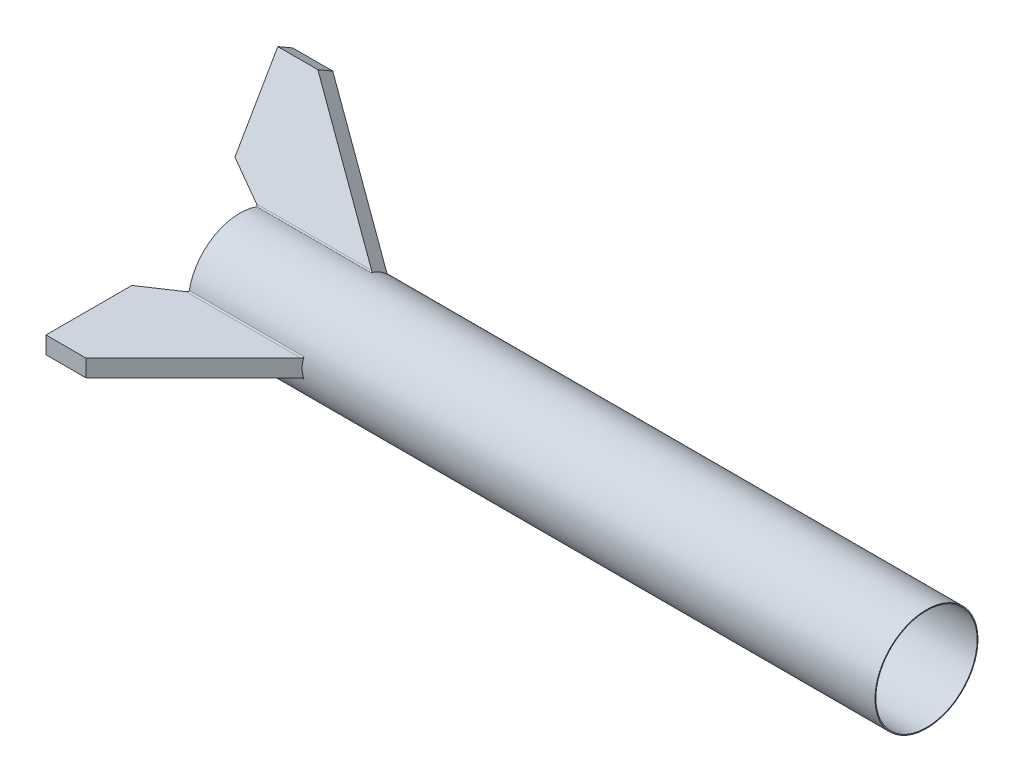
ISO-10303-21;
HEADER;
FILE_DESCRIPTION(('STEP AP214'),'2;1');
FILE_NAME('part.step','',(''),(''),'','','');
FILE_SCHEMA(('AUTOMOTIVE_DESIGN { 1 0 10303 214 1 1 1 1 }'));
ENDSEC;
DATA;
#1=APPLICATION_CONTEXT('core data for automotive mechanical design processes');
#2=APPLICATION_PROTOCOL_DEFINITION('international standard','automotive_design',2000,#1);
#3=PRODUCT_CONTEXT('',#1,'mechanical');
#4=PRODUCT('Part','Part','',(#3));
#5=PRODUCT_RELATED_PRODUCT_CATEGORY('part','',(#4));
#6=PRODUCT_DEFINITION_FORMATION('','',#4);
#7=PRODUCT_DEFINITION_CONTEXT('part definition',#1,'design');
#8=PRODUCT_DEFINITION('design','',#6,#7);
#9=PRODUCT_DEFINITION_SHAPE('','',#8);
#10=(LENGTH_UNIT() NAMED_UNIT(*) SI_UNIT(.MILLI.,.METRE.));
#11=(NAMED_UNIT(*) PLANE_ANGLE_UNIT() SI_UNIT($,.RADIAN.));
#12=(NAMED_UNIT(*) SI_UNIT($,.STERADIAN.) SOLID_ANGLE_UNIT());
#13=UNCERTAINTY_MEASURE_WITH_UNIT(LENGTH_MEASURE(1.E-05),#10,'distance_accuracy_value','');
#14=(GEOMETRIC_REPRESENTATION_CONTEXT(3) GLOBAL_UNCERTAINTY_ASSIGNED_CONTEXT((#13)) GLOBAL_UNIT_ASSIGNED_CONTEXT((#10,
#11,#12)) REPRESENTATION_CONTEXT('',''));
#15=CARTESIAN_POINT('',(0.,0.,0.));
#16=DIRECTION('',(0.,0.,1.));
#17=DIRECTION('',(1.,0.,0.));
#18=AXIS2_PLACEMENT_3D('',#15,#16,#17);
#19=CARTESIAN_POINT('',(-30480.,0.,0.));
#20=DIRECTION('',(1.,0.,0.));
#21=DIRECTION('',(0.,0.,-1.));
#22=AXIS2_PLACEMENT_3D('',#19,#20,#21);
#23=CYLINDRICAL_SURFACE('',#22,4572.);
#24=CARTESIAN_POINT('',(-30480.,0.,0.));
#25=DIRECTION('',(1.,0.,0.));
#26=DIRECTION('',(0.,0.,-1.));
#27=AXIS2_PLACEMENT_3D('',#24,#25,#26);
#28=CIRCLE('',#27,4572.);
#29=CARTESIAN_POINT('',(-30480.,-3455.47625986534,-2993.80490638703));
#30=VERTEX_POINT('',#29);
#31=CARTESIAN_POINT('',(-30480.,3455.47625986538,-2993.80490638698));
#32=VERTEX_POINT('',#31);
#33=EDGE_CURVE('E862',#30,#32,#28,.T.);
#34=ORIENTED_EDGE('',*,*,#33,.T.);
#35=DIRECTION('',(1.,0.,0.));
#36=VECTOR('',#35,1.);
#37=CARTESIAN_POINT('',(-30480.,3455.47625986538,-2993.80490638698));
#38=LINE('',#37,#36);
#39=CARTESIAN_POINT('',(-20301.379881689,3455.47625986538,-2993.80490638698));
#40=VERTEX_POINT('',#39);
#41=EDGE_CURVE('E921',#32,#40,#38,.T.);
#42=ORIENTED_EDGE('',*,*,#41,.T.);
#43=CARTESIAN_POINT('',(-15811.9472052781,0.,0.));
#44=DIRECTION('',(0.707106781186551,0.612372435695794,-0.353553390593266));
#45=DIRECTION('',(0.707106781186544,-0.612372435695801,0.35355339059327));
#46=AXIS2_PLACEMENT_3D('',#43,#44,#45);
#47=ELLIPSE('',#46,6465.78440716975,4572.);
#48=CARTESIAN_POINT('',(-20301.379881689,4320.44923283834,-1495.62777002389));
#49=VERTEX_POINT('',#48);
#50=EDGE_CURVE('E776',#49,#40,#47,.F.);
#51=ORIENTED_EDGE('',*,*,#50,.F.);
#52=DIRECTION('',(1.,0.,0.));
#53=VECTOR('',#52,1.);
#54=CARTESIAN_POINT('',(-30480.,4320.44923283834,-1495.62777002388));
#55=LINE('',#54,#53);
#56=CARTESIAN_POINT('',(-30480.,4320.44923283834,-1495.62777002389));
#57=VERTEX_POINT('',#56);
#58=EDGE_CURVE('E917',#49,#57,#55,.F.);
#59=ORIENTED_EDGE('',*,*,#58,.T.);
#60=CARTESIAN_POINT('',(-30480.,864.972972972973,4489.43267641094));
#61=VERTEX_POINT('',#60);
#62=EDGE_CURVE('E876',#57,#61,#28,.T.);
#63=ORIENTED_EDGE('',*,*,#62,.T.);
#64=DIRECTION('',(1.,0.,0.));
#65=VECTOR('',#64,1.);
#66=CARTESIAN_POINT('',(-30480.,864.972972972973,4489.43267641094));
#67=LINE('',#66,#65);
#68=CARTESIAN_POINT('',(-20301.379881689,864.972972972972,4489.43267641094));
#69=VERTEX_POINT('',#68);
#70=EDGE_CURVE('E851',#61,#69,#67,.T.);
#71=ORIENTED_EDGE('',*,*,#70,.T.);
#72=CARTESIAN_POINT('',(-15811.9472052781,0.,0.));
#73=DIRECTION('',(0.707106781186551,0.,0.707106781186543));
#74=DIRECTION('',(0.707106781186544,0.,-0.707106781186552));
#75=AXIS2_PLACEMENT_3D('',#72,#73,#74);
#76=ELLIPSE('',#75,6465.78440716975,4572.);
#77=CARTESIAN_POINT('',(-20301.379881689,-864.972972972973,4489.43267641094));
#78=VERTEX_POINT('',#77);
#79=EDGE_CURVE('E861',#78,#69,#76,.F.);
#80=ORIENTED_EDGE('',*,*,#79,.F.);
#81=DIRECTION('',(1.,0.,0.));
#82=VECTOR('',#81,1.);
#83=CARTESIAN_POINT('',(-30480.,-864.972972972973,4489.43267641094));
#84=LINE('',#83,#82);
#85=CARTESIAN_POINT('',(-30480.,-864.972972972973,4489.43267641094));
#86=VERTEX_POINT('',#85);
#87=EDGE_CURVE('E854',#78,#86,#84,.F.);
#88=ORIENTED_EDGE('',*,*,#87,.T.);
#89=CARTESIAN_POINT('',(-30480.,-4320.44923283832,-1495.62777002394));
#90=VERTEX_POINT('',#89);
#91=EDGE_CURVE('E857',#86,#90,#28,.T.);
#92=ORIENTED_EDGE('',*,*,#91,.T.);
#93=DIRECTION('',(1.,0.,0.));
#94=VECTOR('',#93,1.);
#95=CARTESIAN_POINT('',(-30480.,-4320.44923283832,-1495.62777002394));
#96=LINE('',#95,#94);
#97=CARTESIAN_POINT('',(-20301.379881689,-4320.44923283832,-1495.62777002394));
#98=VERTEX_POINT('',#97);
#99=EDGE_CURVE('E880',#90,#98,#96,.T.);
#100=ORIENTED_EDGE('',*,*,#99,.T.);
#101=CARTESIAN_POINT('',(-15811.9472052781,0.,0.));
#102=DIRECTION('',(0.707106781186551,-0.612372435695789,-0.353553390593275));
#103=DIRECTION('',(0.707106781186544,0.612372435695796,0.353553390593279));
#104=AXIS2_PLACEMENT_3D('',#101,#102,#103);
#105=ELLIPSE('',#104,6465.78440716975,4572.);
#106=CARTESIAN_POINT('',(-20301.379881689,-3455.47625986534,-2993.80490638703));
#107=VERTEX_POINT('',#106);
#108=EDGE_CURVE('E803',#107,#98,#105,.F.);
#109=ORIENTED_EDGE('',*,*,#108,.F.);
#110=DIRECTION('',(1.,0.,0.));
#111=VECTOR('',#110,1.);
#112=CARTESIAN_POINT('',(-30480.,-3455.47625986534,-2993.80490638703));
#113=LINE('',#112,#111);
#114=EDGE_CURVE('E878',#107,#30,#113,.F.);
#115=ORIENTED_EDGE('',*,*,#114,.T.);
#116=EDGE_LOOP('',(#34,#42,#51,#59,#63,#71,#80,#88,#92,#100,#109,#115));
#117=FACE_BOUND('',#116,.T.);
#118=CARTESIAN_POINT('',(30480.,0.,0.));
#119=DIRECTION('',(1.,0.,0.));
#120=DIRECTION('',(0.,0.,-1.));
#121=AXIS2_PLACEMENT_3D('',#118,#119,#120);
#122=CIRCLE('',#121,4572.);
#123=CARTESIAN_POINT('',(30480.,0.,-4572.));
#124=VERTEX_POINT('',#123);
#125=EDGE_CURVE('E867',#124,#124,#122,.T.);
#126=ORIENTED_EDGE('',*,*,#125,.F.);
#127=EDGE_LOOP('',(#126));
#128=FACE_BOUND('',#127,.T.);
#129=ADVANCED_FACE('F91',(#117,#128),#23,.T.);
#130=CARTESIAN_POINT('',(-30480.,0.,0.));
#131=DIRECTION('',(1.,0.,0.));
#132=DIRECTION('',(0.,0.,-1.));
#133=AXIS2_PLACEMENT_3D('',#130,#131,#132);
#134=PLANE('',#133);
#135=CARTESIAN_POINT('',(-30480.,0.,0.));
#136=DIRECTION('',(1.,0.,0.));
#137=DIRECTION('',(0.,0.,-1.));
#138=AXIS2_PLACEMENT_3D('',#135,#136,#137);
#139=CIRCLE('',#138,4495.8);
#140=CARTESIAN_POINT('',(-30480.,0.,-4495.8));
#141=VERTEX_POINT('',#140);
#142=EDGE_CURVE('E1196',#141,#141,#139,.T.);
#143=ORIENTED_EDGE('',*,*,#142,.T.);
#144=EDGE_LOOP('',(#143));
#145=FACE_BOUND('',#144,.T.);
#146=ORIENTED_EDGE('',*,*,#62,.F.);
#147=CARTESIAN_POINT('',(-30480.,4440.46171152829,-1537.17298585788));
#148=DIRECTION('',(1.,0.,0.));
#149=DIRECTION('',(0.,0.,-1.));
#150=AXIS2_PLACEMENT_3D('',#147,#148,#149);
#151=CIRCLE('',#150,127.);
#152=CARTESIAN_POINT('',(-30480.,4313.67876095168,-1544.59480794472));
#153=VERTEX_POINT('',#152);
#154=EDGE_CURVE('E107',#57,#153,#151,.T.);
#155=ORIENTED_EDGE('',*,*,#154,.T.);
#156=DIRECTION('',(0.,0.499999999999992,0.866025403784443));
#157=VECTOR('',#156,1.);
#158=CARTESIAN_POINT('',(-30480.,3904.08824183063,-2254.02639736092));
#159=LINE('',#158,#157);
#160=CARTESIAN_POINT('',(-30480.,4285.08824183062,-1594.11503967717));
#161=VERTEX_POINT('',#160);
#162=EDGE_CURVE('E13',#161,#153,#159,.T.);
#163=ORIENTED_EDGE('',*,*,#162,.F.);
#164=DIRECTION('',(0.,0.499999999999992,0.866025403784443));
#165=VECTOR('',#164,1.);
#166=CARTESIAN_POINT('',(-30480.,3523.08824183063,-2913.93775504466));
#167=LINE('',#166,#165);
#168=CARTESIAN_POINT('',(-30480.,3523.08824183062,-2913.93775504468));
#169=VERTEX_POINT('',#168);
#170=EDGE_CURVE('E501',#169,#161,#167,.T.);
#171=ORIENTED_EDGE('',*,*,#170,.F.);
#172=DIRECTION('',(0.,-0.499999999999992,-0.866025403784443));
#173=VECTOR('',#172,1.);
#174=CARTESIAN_POINT('',(-30480.,3904.08824183062,-2254.02639736092));
#175=LINE('',#174,#173);
#176=CARTESIAN_POINT('',(-30480.,3494.49772270957,-2963.45798677711));
#177=VERTEX_POINT('',#176);
#178=EDGE_CURVE('E100',#169,#177,#175,.T.);
#179=ORIENTED_EDGE('',*,*,#178,.T.);
#180=CARTESIAN_POINT('',(-30480.,3551.4617115283,-3076.96615378662));
#181=DIRECTION('',(1.,0.,0.));
#182=DIRECTION('',(0.,0.,-1.));
#183=AXIS2_PLACEMENT_3D('',#180,#181,#182);
#184=CIRCLE('',#183,127.);
#185=EDGE_CURVE('E929',#177,#32,#184,.T.);
#186=ORIENTED_EDGE('',*,*,#185,.T.);
#187=ORIENTED_EDGE('',*,*,#33,.F.);
#188=CARTESIAN_POINT('',(-30480.,-3551.46171152826,-3076.96615378667));
#189=DIRECTION('',(1.,0.,0.));
#190=DIRECTION('',(0.,0.,-1.));
#191=AXIS2_PLACEMENT_3D('',#188,#189,#190);
#192=CIRCLE('',#191,127.);
#193=CARTESIAN_POINT('',(-30480.,-3494.49772270952,-2963.45798677716));
#194=VERTEX_POINT('',#193);
#195=EDGE_CURVE('E899',#30,#194,#192,.T.);
#196=ORIENTED_EDGE('',*,*,#195,.T.);
#197=DIRECTION('',(0.,0.500000000000004,-0.866025403784436));
#198=VECTOR('',#197,1.);
#199=CARTESIAN_POINT('',(-30480.,-3904.08824183059,-2254.02639736097));
#200=LINE('',#199,#198);
#201=CARTESIAN_POINT('',(-30480.,-3523.08824183059,-2913.93775504471));
#202=VERTEX_POINT('',#201);
#203=EDGE_CURVE('E910',#202,#194,#200,.T.);
#204=ORIENTED_EDGE('',*,*,#203,.F.);
#205=DIRECTION('',(0.,0.500000000000004,-0.866025403784436));
#206=VECTOR('',#205,1.);
#207=CARTESIAN_POINT('',(-30480.,-4285.0882418306,-1594.11503967723));
#208=LINE('',#207,#206);
#209=CARTESIAN_POINT('',(-30480.,-4285.08824183061,-1594.11503967719));
#210=VERTEX_POINT('',#209);
#211=EDGE_CURVE('E718',#210,#202,#208,.T.);
#212=ORIENTED_EDGE('',*,*,#211,.F.);
#213=DIRECTION('',(0.,-0.500000000000004,0.866025403784436));
#214=VECTOR('',#213,1.);
#215=CARTESIAN_POINT('',(-30480.,-3904.08824183059,-2254.02639736097));
#216=LINE('',#215,#214);
#217=CARTESIAN_POINT('',(-30480.,-4313.67876095166,-1544.59480794477));
#218=VERTEX_POINT('',#217);
#219=EDGE_CURVE('E905',#210,#218,#216,.T.);
#220=ORIENTED_EDGE('',*,*,#219,.T.);
#221=CARTESIAN_POINT('',(-30480.,-4440.46171152827,-1537.17298585794));
#222=DIRECTION('',(1.,0.,0.));
#223=DIRECTION('',(0.,0.,-1.));
#224=AXIS2_PLACEMENT_3D('',#221,#222,#223);
#225=CIRCLE('',#224,127.);
#226=EDGE_CURVE('E889',#218,#90,#225,.T.);
#227=ORIENTED_EDGE('',*,*,#226,.T.);
#228=ORIENTED_EDGE('',*,*,#91,.F.);
#229=CARTESIAN_POINT('',(-30480.,-888.999999999999,4614.13913964458));
#230=DIRECTION('',(1.,0.,0.));
#231=DIRECTION('',(0.,0.,-1.));
#232=AXIS2_PLACEMENT_3D('',#229,#230,#231);
#233=CIRCLE('',#232,127.);
#234=CARTESIAN_POINT('',(-30480.,-819.181038242123,4508.0527947219));
#235=VERTEX_POINT('',#234);
#236=EDGE_CURVE('E828',#86,#235,#233,.T.);
#237=ORIENTED_EDGE('',*,*,#236,.T.);
#238=DIRECTION('',(0.,-1.,0.));
#239=VECTOR('',#238,1.);
#240=CARTESIAN_POINT('',(-30480.,0.,4508.0527947219));
#241=LINE('',#240,#239);
#242=CARTESIAN_POINT('',(-30480.,-762.,4508.05279472191));
#243=VERTEX_POINT('',#242);
#244=EDGE_CURVE('E809',#243,#235,#241,.T.);
#245=ORIENTED_EDGE('',*,*,#244,.F.);
#246=DIRECTION('',(0.,-1.,0.));
#247=VECTOR('',#246,1.);
#248=CARTESIAN_POINT('',(-30480.,762.,4508.05279472191));
#249=LINE('',#248,#247);
#250=CARTESIAN_POINT('',(-30480.,762.000000000028,4508.0527947219));
#251=VERTEX_POINT('',#250);
#252=EDGE_CURVE('E975',#251,#243,#249,.T.);
#253=ORIENTED_EDGE('',*,*,#252,.F.);
#254=DIRECTION('',(0.,1.,0.));
#255=VECTOR('',#254,1.);
#256=CARTESIAN_POINT('',(-30480.,0.,4508.0527947219));
#257=LINE('',#256,#255);
#258=CARTESIAN_POINT('',(-30480.,819.181038242125,4508.0527947219));
#259=VERTEX_POINT('',#258);
#260=EDGE_CURVE('E813',#251,#259,#257,.T.);
#261=ORIENTED_EDGE('',*,*,#260,.T.);
#262=CARTESIAN_POINT('',(-30480.,889.,4614.13913964458));
#263=DIRECTION('',(1.,0.,0.));
#264=DIRECTION('',(0.,0.,-1.));
#265=AXIS2_PLACEMENT_3D('',#262,#263,#264);
#266=CIRCLE('',#265,127.);
#267=EDGE_CURVE('E839',#259,#61,#266,.T.);
#268=ORIENTED_EDGE('',*,*,#267,.T.);
#269=EDGE_LOOP('',(#146,#155,#163,#171,#179,#186,#187,#196,#204,#212,#220,#227,#228,#237,#245,
#253,#261,#268));
#270=FACE_BOUND('',#269,.T.);
#271=ADVANCED_FACE('F777',(#145,#270),#134,.F.);
#272=CARTESIAN_POINT('',(30480.,0.,0.));
#273=DIRECTION('',(1.,0.,0.));
#274=DIRECTION('',(0.,0.,-1.));
#275=AXIS2_PLACEMENT_3D('',#272,#273,#274);
#276=PLANE('',#275);
#277=CARTESIAN_POINT('',(30480.,0.,0.));
#278=DIRECTION('',(1.,0.,0.));
#279=DIRECTION('',(0.,0.,-1.));
#280=AXIS2_PLACEMENT_3D('',#277,#278,#279);
#281=CIRCLE('',#280,4495.8);
#282=CARTESIAN_POINT('',(30480.,0.,-4495.8));
#283=VERTEX_POINT('',#282);
#284=EDGE_CURVE('E979',#283,#283,#281,.T.);
#285=ORIENTED_EDGE('',*,*,#284,.F.);
#286=EDGE_LOOP('',(#285));
#287=FACE_BOUND('',#286,.T.);
#288=ORIENTED_EDGE('',*,*,#125,.T.);
#289=EDGE_LOOP('',(#288));
#290=FACE_BOUND('',#289,.T.);
#291=ADVANCED_FACE('F787',(#287,#290),#276,.T.);
#292=CARTESIAN_POINT('',(-30480.,0.,0.));
#293=DIRECTION('',(1.,0.,0.));
#294=DIRECTION('',(0.,0.,-1.));
#295=AXIS2_PLACEMENT_3D('',#292,#293,#294);
#296=CYLINDRICAL_SURFACE('',#295,4495.8);
#297=ORIENTED_EDGE('',*,*,#142,.F.);
#298=EDGE_LOOP('',(#297));
#299=FACE_BOUND('',#298,.T.);
#300=ORIENTED_EDGE('',*,*,#284,.T.);
#301=EDGE_LOOP('',(#300));
#302=FACE_BOUND('',#301,.T.);
#303=ADVANCED_FACE('F1045',(#299,#302),#296,.F.);
#304=CARTESIAN_POINT('',(-33528.,0.,0.));
#305=DIRECTION('',(-1.,0.,0.));
#306=DIRECTION('',(0.,0.,1.));
#307=AXIS2_PLACEMENT_3D('',#304,#305,#306);
#308=PLANE('',#307);
#309=DIRECTION('',(0.,-1.,0.));
#310=VECTOR('',#309,1.);
#311=CARTESIAN_POINT('',(-33528.,762.,6540.05279472191));
#312=LINE('',#311,#310);
#313=CARTESIAN_POINT('',(-33528.,762.,6540.05279472191));
#314=VERTEX_POINT('',#313);
#315=CARTESIAN_POINT('',(-33528.,-762.,6540.05279472191));
#316=VERTEX_POINT('',#315);
#317=EDGE_CURVE('E769',#314,#316,#312,.T.);
#318=ORIENTED_EDGE('',*,*,#317,.T.);
#319=DIRECTION('',(0.,0.,1.));
#320=VECTOR('',#319,1.);
#321=CARTESIAN_POINT('',(-33528.,-762.,6540.05279472191));
#322=LINE('',#321,#320);
#323=CARTESIAN_POINT('',(-33528.,-762.,14160.0527947219));
#324=VERTEX_POINT('',#323);
#325=EDGE_CURVE('E1137',#316,#324,#322,.T.);
#326=ORIENTED_EDGE('',*,*,#325,.T.);
#327=DIRECTION('',(0.,1.,0.));
#328=VECTOR('',#327,1.);
#329=CARTESIAN_POINT('',(-33528.,762.,14160.0527947219));
#330=LINE('',#329,#328);
#331=CARTESIAN_POINT('',(-33528.,762.,14160.0527947219));
#332=VERTEX_POINT('',#331);
#333=EDGE_CURVE('E1128',#324,#332,#330,.T.);
#334=ORIENTED_EDGE('',*,*,#333,.T.);
#335=DIRECTION('',(0.,0.,-1.));
#336=VECTOR('',#335,1.);
#337=CARTESIAN_POINT('',(-33528.,762.,6540.05279472191));
#338=LINE('',#337,#336);
#339=EDGE_CURVE('E1117',#332,#314,#338,.T.);
#340=ORIENTED_EDGE('',*,*,#339,.T.);
#341=EDGE_LOOP('',(#318,#326,#334,#340));
#342=FACE_BOUND('',#341,.T.);
#343=ADVANCED_FACE('F615',(#342),#308,.T.);
#344=CARTESIAN_POINT('',(0.,762.,0.));
#345=DIRECTION('',(0.,1.,0.));
#346=DIRECTION('',(0.,0.,1.));
#347=AXIS2_PLACEMENT_3D('',#344,#345,#346);
#348=PLANE('',#347);
#349=CARTESIAN_POINT('',(-29971.9999999999,762.,14160.0527947219));
#350=DIRECTION('',(0.707106781186543,0.,-0.707106781186552));
#351=VECTOR('',#350,1.);
#352=LINE('',#349,#351);
#353=CARTESIAN_POINT('',(-29971.9999999999,762.,14160.0527947219));
#354=VERTEX_POINT('',#353);
#355=CARTESIAN_POINT('',(-20426.0863449227,762.,4614.13913964458));
#356=VERTEX_POINT('',#355);
#357=EDGE_CURVE('E1073',#354,#356,#352,.T.);
#358=ORIENTED_EDGE('',*,*,#357,.T.);
#359=DIRECTION('',(-1.,0.,0.));
#360=VECTOR('',#359,1.);
#361=CARTESIAN_POINT('',(-30480.,762.,4614.13913964458));
#362=LINE('',#361,#360);
#363=CARTESIAN_POINT('',(-30639.129517384,762.,4614.13913964458));
#364=VERTEX_POINT('',#363);
#365=EDGE_CURVE('E856',#356,#364,#362,.T.);
#366=ORIENTED_EDGE('',*,*,#365,.T.);
#367=CARTESIAN_POINT('',(-33528.,762.,6540.05279472191));
#368=DIRECTION('',(0.832050294337843,0.,-0.55470019622523));
#369=VECTOR('',#368,1.);
#370=LINE('',#367,#369);
#371=EDGE_CURVE('E1066',#314,#364,#370,.T.);
#372=ORIENTED_EDGE('',*,*,#371,.F.);
#373=ORIENTED_EDGE('',*,*,#339,.F.);
#374=CARTESIAN_POINT('',(-33528.,762.,14160.0527947219));
#375=DIRECTION('',(1.,0.,0.));
#376=VECTOR('',#375,1.);
#377=LINE('',#374,#376);
#378=EDGE_CURVE('E1085',#332,#354,#377,.T.);
#379=ORIENTED_EDGE('',*,*,#378,.T.);
#380=EDGE_LOOP('',(#358,#366,#372,#373,#379));
#381=FACE_BOUND('',#380,.T.);
#382=ADVANCED_FACE('F1002',(#381),#348,.T.);
#383=CARTESIAN_POINT('',(-7297.82178705144,0.,-10946.7326805771));
#384=DIRECTION('',(-0.554700196225229,0.,-0.832050294337844));
#385=DIRECTION('',(-0.832050294337844,0.,0.554700196225229));
#386=AXIS2_PLACEMENT_3D('',#383,#384,#385);
#387=PLANE('',#386);
#388=ORIENTED_EDGE('',*,*,#371,.T.);
#389=CARTESIAN_POINT('',(-30639.129517384,889.,4614.13913964458));
#390=DIRECTION('',(-0.554700196225229,0.,-0.832050294337844));
#391=DIRECTION('',(0.832050294337844,0.,-0.554700196225229));
#392=AXIS2_PLACEMENT_3D('',#389,#390,#391);
#393=ELLIPSE('',#392,228.952505991963,127.);
#394=EDGE_CURVE('E842',#364,#259,#393,.F.);
#395=ORIENTED_EDGE('',*,*,#394,.T.);
#396=ORIENTED_EDGE('',*,*,#260,.F.);
#397=ORIENTED_EDGE('',*,*,#252,.T.);
#398=ORIENTED_EDGE('',*,*,#244,.T.);
#399=CARTESIAN_POINT('',(-30639.129517384,-888.999999999999,4614.13913964458));
#400=DIRECTION('',(-0.554700196225229,0.,-0.832050294337844));
#401=DIRECTION('',(0.832050294337844,0.,-0.554700196225229));
#402=AXIS2_PLACEMENT_3D('',#399,#400,#401);
#403=ELLIPSE('',#402,228.952505991963,127.);
#404=CARTESIAN_POINT('',(-30639.129517384,-762.,4614.13913964458));
#405=VERTEX_POINT('',#404);
#406=EDGE_CURVE('E819',#235,#405,#403,.F.);
#407=ORIENTED_EDGE('',*,*,#406,.T.);
#408=CARTESIAN_POINT('',(-33528.,-762.,6540.05279472191));
#409=DIRECTION('',(0.832050294337843,0.,-0.55470019622523));
#410=VECTOR('',#409,1.);
#411=LINE('',#408,#410);
#412=EDGE_CURVE('E980',#316,#405,#411,.T.);
#413=ORIENTED_EDGE('',*,*,#412,.F.);
#414=ORIENTED_EDGE('',*,*,#317,.F.);
#415=EDGE_LOOP('',(#388,#395,#396,#397,#398,#407,#413,#414));
#416=FACE_BOUND('',#415,.T.);
#417=ADVANCED_FACE('F978',(#416),#387,.T.);
#418=CARTESIAN_POINT('',(-29971.9999999999,762.,14160.0527947219));
#419=DIRECTION('',(0.707106781186551,0.,0.707106781186543));
#420=DIRECTION('',(0.,-1.,0.));
#421=AXIS2_PLACEMENT_3D('',#418,#419,#420);
#422=PLANE('',#421);
#423=CARTESIAN_POINT('',(-29971.9999999999,-762.000000000001,14160.0527947219));
#424=DIRECTION('',(0.707106781186543,0.,-0.707106781186552));
#425=VECTOR('',#424,1.);
#426=LINE('',#423,#425);
#427=CARTESIAN_POINT('',(-29971.9999999999,-762.000000000001,14160.0527947219));
#428=VERTEX_POINT('',#427);
#429=CARTESIAN_POINT('',(-20426.0863449227,-762.,4614.13913964458));
#430=VERTEX_POINT('',#429);
#431=EDGE_CURVE('E1097',#428,#430,#426,.T.);
#432=ORIENTED_EDGE('',*,*,#431,.T.);
#433=CARTESIAN_POINT('',(-20426.0863449227,-888.999999999999,4614.13913964458));
#434=DIRECTION('',(0.707106781186551,0.,0.707106781186543));
#435=DIRECTION('',(0.707106781186544,0.,-0.707106781186552));
#436=AXIS2_PLACEMENT_3D('',#433,#434,#435);
#437=ELLIPSE('',#436,179.605122421382,127.);
#438=EDGE_CURVE('E830',#430,#78,#437,.F.);
#439=ORIENTED_EDGE('',*,*,#438,.T.);
#440=ORIENTED_EDGE('',*,*,#79,.T.);
#441=CARTESIAN_POINT('',(-20426.0863449227,889.,4614.13913964458));
#442=DIRECTION('',(0.707106781186551,0.,0.707106781186543));
#443=DIRECTION('',(0.707106781186544,0.,-0.707106781186552));
#444=AXIS2_PLACEMENT_3D('',#441,#442,#443);
#445=ELLIPSE('',#444,179.605122421382,127.);
#446=EDGE_CURVE('E835',#69,#356,#445,.F.);
#447=ORIENTED_EDGE('',*,*,#446,.T.);
#448=ORIENTED_EDGE('',*,*,#357,.F.);
#449=DIRECTION('',(0.,-1.,0.));
#450=VECTOR('',#449,1.);
#451=CARTESIAN_POINT('',(-29971.9999999999,-6.66133814775094E-13,14160.0527947219));
#452=LINE('',#451,#450);
#453=EDGE_CURVE('E1058',#354,#428,#452,.T.);
#454=ORIENTED_EDGE('',*,*,#453,.T.);
#455=EDGE_LOOP('',(#432,#439,#440,#447,#448,#454));
#456=FACE_BOUND('',#455,.T.);
#457=ADVANCED_FACE('F1001',(#456),#422,.T.);
#458=CARTESIAN_POINT('',(-33528.,762.,14160.0527947219));
#459=DIRECTION('',(0.,0.,1.));
#460=DIRECTION('',(0.,-1.,0.));
#461=AXIS2_PLACEMENT_3D('',#458,#459,#460);
#462=PLANE('',#461);
#463=ORIENTED_EDGE('',*,*,#333,.F.);
#464=CARTESIAN_POINT('',(-33528.,-761.999999999999,14160.0527947219));
#465=DIRECTION('',(1.,0.,0.));
#466=VECTOR('',#465,1.);
#467=LINE('',#464,#466);
#468=EDGE_CURVE('E1027',#324,#428,#467,.T.);
#469=ORIENTED_EDGE('',*,*,#468,.T.);
#470=ORIENTED_EDGE('',*,*,#453,.F.);
#471=ORIENTED_EDGE('',*,*,#378,.F.);
#472=EDGE_LOOP('',(#463,#469,#470,#471));
#473=FACE_BOUND('',#472,.T.);
#474=ADVANCED_FACE('F1043',(#473),#462,.T.);
#475=CARTESIAN_POINT('',(0.,-761.999999999999,0.));
#476=DIRECTION('',(0.,-1.,0.));
#477=DIRECTION('',(1.,0.,0.));
#478=AXIS2_PLACEMENT_3D('',#475,#476,#477);
#479=PLANE('',#478);
#480=ORIENTED_EDGE('',*,*,#412,.T.);
#481=DIRECTION('',(-1.,0.,0.));
#482=VECTOR('',#481,1.);
#483=CARTESIAN_POINT('',(-20320.,-761.999999999999,4614.13913964458));
#484=LINE('',#483,#482);
#485=EDGE_CURVE('E846',#405,#430,#484,.F.);
#486=ORIENTED_EDGE('',*,*,#485,.T.);
#487=ORIENTED_EDGE('',*,*,#431,.F.);
#488=ORIENTED_EDGE('',*,*,#468,.F.);
#489=ORIENTED_EDGE('',*,*,#325,.F.);
#490=EDGE_LOOP('',(#480,#486,#487,#488,#489));
#491=FACE_BOUND('',#490,.T.);
#492=ADVANCED_FACE('F1034',(#491),#479,.T.);
#493=CARTESIAN_POINT('',(-30480.,889.,4614.13913964458));
#494=DIRECTION('',(1.,0.,0.));
#495=DIRECTION('',(0.,0.,-1.));
#496=AXIS2_PLACEMENT_3D('',#493,#494,#495);
#497=CYLINDRICAL_SURFACE('',#496,127.);
#498=ORIENTED_EDGE('',*,*,#446,.F.);
#499=ORIENTED_EDGE('',*,*,#70,.F.);
#500=ORIENTED_EDGE('',*,*,#267,.F.);
#501=ORIENTED_EDGE('',*,*,#394,.F.);
#502=ORIENTED_EDGE('',*,*,#365,.F.);
#503=EDGE_LOOP('',(#498,#499,#500,#501,#502));
#504=FACE_BOUND('',#503,.T.);
#505=ADVANCED_FACE('F1042',(#504),#497,.F.);
#506=CARTESIAN_POINT('',(-30480.,-888.999999999999,4614.13913964458));
#507=DIRECTION('',(1.,0.,0.));
#508=DIRECTION('',(0.,0.,-1.));
#509=AXIS2_PLACEMENT_3D('',#506,#507,#508);
#510=CYLINDRICAL_SURFACE('',#509,127.);
#511=ORIENTED_EDGE('',*,*,#236,.F.);
#512=ORIENTED_EDGE('',*,*,#87,.F.);
#513=ORIENTED_EDGE('',*,*,#438,.F.);
#514=ORIENTED_EDGE('',*,*,#485,.F.);
#515=ORIENTED_EDGE('',*,*,#406,.F.);
#516=EDGE_LOOP('',(#511,#512,#513,#514,#515));
#517=FACE_BOUND('',#516,.T.);
#518=ADVANCED_FACE('F973',(#517),#510,.F.);
#519=CARTESIAN_POINT('',(-33528.,0.,0.));
#520=DIRECTION('',(-1.,0.,0.));
#521=DIRECTION('',(0.,-0.866025403784436,-0.500000000000004));
#522=AXIS2_PLACEMENT_3D('',#519,#520,#521);
#523=PLANE('',#522);
#524=DIRECTION('',(0.,0.500000000000004,-0.866025403784436));
#525=VECTOR('',#524,1.);
#526=CARTESIAN_POINT('',(-33528.,-6044.85186232057,-2610.11503967724));
#527=LINE('',#526,#525);
#528=CARTESIAN_POINT('',(-33528.,-6044.85186232057,-2610.11503967724));
#529=VERTEX_POINT('',#528);
#530=CARTESIAN_POINT('',(-33528.,-5282.85186232057,-3929.93775504472));
#531=VERTEX_POINT('',#530);
#532=EDGE_CURVE('E511',#529,#531,#527,.T.);
#533=ORIENTED_EDGE('',*,*,#532,.T.);
#534=DIRECTION('',(0.,-0.866025403784436,-0.500000000000004));
#535=VECTOR('',#534,1.);
#536=CARTESIAN_POINT('',(-33528.,-5282.85186232057,-3929.93775504472));
#537=LINE('',#536,#535);
#538=CARTESIAN_POINT('',(-33528.,-11881.965439158,-7739.93775504475));
#539=VERTEX_POINT('',#538);
#540=EDGE_CURVE('E514',#531,#539,#537,.T.);
#541=ORIENTED_EDGE('',*,*,#540,.T.);
#542=DIRECTION('',(0.,-0.500000000000004,0.866025403784436));
#543=VECTOR('',#542,1.);
#544=CARTESIAN_POINT('',(-33528.,-12643.965439158,-6420.11503967727));
#545=LINE('',#544,#543);
#546=CARTESIAN_POINT('',(-33528.,-12643.965439158,-6420.11503967727));
#547=VERTEX_POINT('',#546);
#548=EDGE_CURVE('E688',#539,#547,#545,.T.);
#549=ORIENTED_EDGE('',*,*,#548,.T.);
#550=DIRECTION('',(0.,0.866025403784436,0.500000000000004));
#551=VECTOR('',#550,1.);
#552=CARTESIAN_POINT('',(-33528.,-6044.85186232057,-2610.11503967724));
#553=LINE('',#552,#551);
#554=EDGE_CURVE('E677',#547,#529,#553,.T.);
#555=ORIENTED_EDGE('',*,*,#554,.T.);
#556=EDGE_LOOP('',(#533,#541,#549,#555));
#557=FACE_BOUND('',#556,.T.);
#558=ADVANCED_FACE('F382',(#557),#523,.T.);
#559=CARTESIAN_POINT('',(0.,-381.000000000003,659.911357683741));
#560=DIRECTION('',(0.,-0.500000000000004,0.866025403784436));
#561=DIRECTION('',(0.,-0.866025403784436,-0.500000000000004));
#562=AXIS2_PLACEMENT_3D('',#559,#560,#561);
#563=PLANE('',#562);
#564=CARTESIAN_POINT('',(-29971.9999999999,-12643.965439158,-6420.11503967727));
#565=DIRECTION('',(0.707106781186544,0.612372435695796,0.353553390593279));
#566=VECTOR('',#565,1.);
#567=LINE('',#564,#566);
#568=CARTESIAN_POINT('',(-29971.9999999999,-12643.965439158,-6420.11503967727));
#569=VERTEX_POINT('',#568);
#570=CARTESIAN_POINT('',(-20426.0863449227,-4376.96171152828,-1647.15821213857));
#571=VERTEX_POINT('',#570);
#572=EDGE_CURVE('E642',#569,#571,#567,.T.);
#573=ORIENTED_EDGE('',*,*,#572,.T.);
#574=DIRECTION('',(-1.,0.,0.));
#575=VECTOR('',#574,1.);
#576=CARTESIAN_POINT('',(-30480.,-4376.96171152827,-1647.15821213857));
#577=LINE('',#576,#575);
#578=CARTESIAN_POINT('',(-30639.129517384,-4376.96171152828,-1647.15821213857));
#579=VERTEX_POINT('',#578);
#580=EDGE_CURVE('E522',#571,#579,#577,.T.);
#581=ORIENTED_EDGE('',*,*,#580,.T.);
#582=CARTESIAN_POINT('',(-33528.,-6044.85186232058,-2610.11503967724));
#583=DIRECTION('',(0.832050294337843,0.480384461415261,0.277350098112617));
#584=VECTOR('',#583,1.);
#585=LINE('',#582,#584);
#586=EDGE_CURVE('E534',#529,#579,#585,.T.);
#587=ORIENTED_EDGE('',*,*,#586,.F.);
#588=ORIENTED_EDGE('',*,*,#554,.F.);
#589=CARTESIAN_POINT('',(-33528.,-12643.965439158,-6420.11503967727));
#590=DIRECTION('',(1.,0.,0.));
#591=VECTOR('',#590,1.);
#592=LINE('',#589,#591);
#593=EDGE_CURVE('E734',#547,#569,#592,.T.);
#594=ORIENTED_EDGE('',*,*,#593,.T.);
#595=EDGE_LOOP('',(#573,#581,#587,#588,#594));
#596=FACE_BOUND('',#595,.T.);
#597=ADVANCED_FACE('F540',(#596),#563,.T.);
#598=CARTESIAN_POINT('',(-7297.82178705144,9480.14858981711,5473.36634028862));
#599=DIRECTION('',(-0.554700196225229,0.72057669212289,0.416025147168925));
#600=DIRECTION('',(-0.832050294337844,-0.48038446141526,-0.277350098112617));
#601=AXIS2_PLACEMENT_3D('',#598,#599,#600);
#602=PLANE('',#601);
#603=ORIENTED_EDGE('',*,*,#586,.T.);
#604=CARTESIAN_POINT('',(-30639.129517384,-4440.46171152827,-1537.17298585794));
#605=DIRECTION('',(-0.554700196225229,0.72057669212289,0.416025147168925));
#606=DIRECTION('',(0.832050294337844,0.48038446141526,0.277350098112617));
#607=AXIS2_PLACEMENT_3D('',#604,#605,#606);
#608=ELLIPSE('',#607,228.952505991963,127.);
#609=EDGE_CURVE('E885',#579,#218,#608,.F.);
#610=ORIENTED_EDGE('',*,*,#609,.T.);
#611=ORIENTED_EDGE('',*,*,#219,.F.);
#612=ORIENTED_EDGE('',*,*,#211,.T.);
#613=ORIENTED_EDGE('',*,*,#203,.T.);
#614=CARTESIAN_POINT('',(-30639.129517384,-3551.46171152826,-3076.96615378667));
#615=DIRECTION('',(-0.554700196225229,0.72057669212289,0.416025147168925));
#616=DIRECTION('',(0.832050294337844,0.48038446141526,0.277350098112617));
#617=AXIS2_PLACEMENT_3D('',#614,#615,#616);
#618=ELLIPSE('',#617,228.952505991963,127.);
#619=CARTESIAN_POINT('',(-30639.129517384,-3614.96171152826,-2966.98092750605));
#620=VERTEX_POINT('',#619);
#621=EDGE_CURVE('E903',#194,#620,#618,.F.);
#622=ORIENTED_EDGE('',*,*,#621,.T.);
#623=CARTESIAN_POINT('',(-33528.,-5282.85186232057,-3929.93775504472));
#624=DIRECTION('',(0.832050294337843,0.48038446141526,0.277350098112617));
#625=VECTOR('',#624,1.);
#626=LINE('',#623,#625);
#627=EDGE_CURVE('E574',#531,#620,#626,.T.);
#628=ORIENTED_EDGE('',*,*,#627,.F.);
#629=ORIENTED_EDGE('',*,*,#532,.F.);
#630=EDGE_LOOP('',(#603,#610,#611,#612,#613,#622,#628,#629));
#631=FACE_BOUND('',#630,.T.);
#632=ADVANCED_FACE('F549',(#631),#602,.T.);
#633=CARTESIAN_POINT('',(-29971.9999999999,-12643.965439158,-6420.11503967727));
#634=DIRECTION('',(0.707106781186551,-0.612372435695789,-0.353553390593275));
#635=DIRECTION('',(0.,0.500000000000004,-0.866025403784436));
#636=AXIS2_PLACEMENT_3D('',#633,#634,#635);
#637=PLANE('',#636);
#638=CARTESIAN_POINT('',(-29971.9999999999,-11881.965439158,-7739.93775504475));
#639=DIRECTION('',(0.707106781186543,0.612372435695796,0.353553390593279));
#640=VECTOR('',#639,1.);
#641=LINE('',#638,#640);
#642=CARTESIAN_POINT('',(-29971.9999999999,-11881.965439158,-7739.93775504475));
#643=VERTEX_POINT('',#642);
#644=CARTESIAN_POINT('',(-20426.0863449227,-3614.96171152826,-2966.98092750605));
#645=VERTEX_POINT('',#644);
#646=EDGE_CURVE('E963',#643,#645,#641,.T.);
#647=ORIENTED_EDGE('',*,*,#646,.T.);
#648=CARTESIAN_POINT('',(-20426.0863449227,-3551.46171152826,-3076.96615378667));
#649=DIRECTION('',(0.707106781186551,-0.612372435695789,-0.353553390593275));
#650=DIRECTION('',(0.707106781186544,0.612372435695796,0.353553390593279));
#651=AXIS2_PLACEMENT_3D('',#648,#649,#650);
#652=ELLIPSE('',#651,179.605122421382,127.);
#653=EDGE_CURVE('E895',#645,#107,#652,.F.);
#654=ORIENTED_EDGE('',*,*,#653,.T.);
#655=ORIENTED_EDGE('',*,*,#108,.T.);
#656=CARTESIAN_POINT('',(-20426.0863449227,-4440.46171152827,-1537.17298585794));
#657=DIRECTION('',(0.707106781186551,-0.612372435695789,-0.353553390593275));
#658=DIRECTION('',(0.707106781186544,0.612372435695796,0.353553390593279));
#659=AXIS2_PLACEMENT_3D('',#656,#657,#658);
#660=ELLIPSE('',#659,179.605122421382,127.);
#661=EDGE_CURVE('E893',#98,#571,#660,.F.);
#662=ORIENTED_EDGE('',*,*,#661,.T.);
#663=ORIENTED_EDGE('',*,*,#572,.F.);
#664=DIRECTION('',(0.,0.500000000000004,-0.866025403784436));
#665=VECTOR('',#664,1.);
#666=CARTESIAN_POINT('',(-29971.9999999999,-12262.965439158,-7080.02639736101));
#667=LINE('',#666,#665);
#668=EDGE_CURVE('E629',#569,#643,#667,.T.);
#669=ORIENTED_EDGE('',*,*,#668,.T.);
#670=EDGE_LOOP('',(#647,#654,#655,#662,#663,#669));
#671=FACE_BOUND('',#670,.T.);
#672=ADVANCED_FACE('F647',(#671),#637,.T.);
#673=CARTESIAN_POINT('',(-33528.,-12643.965439158,-6420.11503967727));
#674=DIRECTION('',(0.,-0.866025403784436,-0.500000000000004));
#675=DIRECTION('',(0.,0.500000000000004,-0.866025403784436));
#676=AXIS2_PLACEMENT_3D('',#673,#674,#675);
#677=PLANE('',#676);
#678=ORIENTED_EDGE('',*,*,#548,.F.);
#679=CARTESIAN_POINT('',(-33528.,-11881.965439158,-7739.93775504475));
#680=DIRECTION('',(1.,0.,0.));
#681=VECTOR('',#680,1.);
#682=LINE('',#679,#681);
#683=EDGE_CURVE('E596',#539,#643,#682,.T.);
#684=ORIENTED_EDGE('',*,*,#683,.T.);
#685=ORIENTED_EDGE('',*,*,#668,.F.);
#686=ORIENTED_EDGE('',*,*,#593,.F.);
#687=EDGE_LOOP('',(#678,#684,#685,#686));
#688=FACE_BOUND('',#687,.T.);
#689=ADVANCED_FACE('F613',(#688),#677,.T.);
#690=CARTESIAN_POINT('',(0.,381.000000000002,-659.911357683739));
#691=DIRECTION('',(0.,0.500000000000004,-0.866025403784436));
#692=DIRECTION('',(1.,0.,0.));
#693=AXIS2_PLACEMENT_3D('',#690,#691,#692);
#694=PLANE('',#693);
#695=ORIENTED_EDGE('',*,*,#627,.T.);
#696=DIRECTION('',(-1.,0.,0.));
#697=VECTOR('',#696,1.);
#698=CARTESIAN_POINT('',(-20320.,-3614.96171152826,-2966.98092750605));
#699=LINE('',#698,#697);
#700=EDGE_CURVE('E882',#620,#645,#699,.F.);
#701=ORIENTED_EDGE('',*,*,#700,.T.);
#702=ORIENTED_EDGE('',*,*,#646,.F.);
#703=ORIENTED_EDGE('',*,*,#683,.F.);
#704=ORIENTED_EDGE('',*,*,#540,.F.);
#705=EDGE_LOOP('',(#695,#701,#702,#703,#704));
#706=FACE_BOUND('',#705,.T.);
#707=ADVANCED_FACE('F603',(#706),#694,.T.);
#708=CARTESIAN_POINT('',(-33528.,0.,0.));
#709=DIRECTION('',(-1.,0.,0.));
#710=DIRECTION('',(0.,0.866025403784443,-0.499999999999992));
#711=AXIS2_PLACEMENT_3D('',#708,#709,#710);
#712=PLANE('',#711);
#713=DIRECTION('',(0.,0.499999999999992,0.866025403784443));
#714=VECTOR('',#713,1.);
#715=CARTESIAN_POINT('',(-33528.,5282.85186232062,-3929.93775504465));
#716=LINE('',#715,#714);
#717=CARTESIAN_POINT('',(-33528.,5282.85186232062,-3929.93775504465));
#718=VERTEX_POINT('',#717);
#719=CARTESIAN_POINT('',(-33528.,6044.85186232061,-2610.11503967715));
#720=VERTEX_POINT('',#719);
#721=EDGE_CURVE('E277',#718,#720,#716,.T.);
#722=ORIENTED_EDGE('',*,*,#721,.T.);
#723=DIRECTION('',(0.,0.866025403784443,-0.499999999999992));
#724=VECTOR('',#723,1.);
#725=CARTESIAN_POINT('',(-33528.,6044.85186232061,-2610.11503967715));
#726=LINE('',#725,#724);
#727=CARTESIAN_POINT('',(-33528.,12643.9654391581,-6420.11503967709));
#728=VERTEX_POINT('',#727);
#729=EDGE_CURVE('E297',#720,#728,#726,.T.);
#730=ORIENTED_EDGE('',*,*,#729,.T.);
#731=DIRECTION('',(0.,-0.499999999999992,-0.866025403784443));
#732=VECTOR('',#731,1.);
#733=CARTESIAN_POINT('',(-33528.,11881.9654391581,-7739.93775504459));
#734=LINE('',#733,#732);
#735=CARTESIAN_POINT('',(-33528.,11881.9654391581,-7739.93775504459));
#736=VERTEX_POINT('',#735);
#737=EDGE_CURVE('E279',#728,#736,#734,.T.);
#738=ORIENTED_EDGE('',*,*,#737,.T.);
#739=DIRECTION('',(0.,-0.866025403784443,0.499999999999992));
#740=VECTOR('',#739,1.);
#741=CARTESIAN_POINT('',(-33528.,5282.85186232062,-3929.93775504465));
#742=LINE('',#741,#740);
#743=EDGE_CURVE('E272',#736,#718,#742,.T.);
#744=ORIENTED_EDGE('',*,*,#743,.T.);
#745=EDGE_LOOP('',(#722,#730,#738,#744));
#746=FACE_BOUND('',#745,.T.);
#747=ADVANCED_FACE('F275',(#746),#712,.T.);
#748=CARTESIAN_POINT('',(0.,-380.999999999994,-659.911357683746));
#749=DIRECTION('',(0.,-0.499999999999992,-0.866025403784443));
#750=DIRECTION('',(0.,0.866025403784443,-0.499999999999992));
#751=AXIS2_PLACEMENT_3D('',#748,#749,#750);
#752=PLANE('',#751);
#753=CARTESIAN_POINT('',(-29971.9999999999,11881.9654391581,-7739.93775504459));
#754=DIRECTION('',(0.707106781186543,-0.612372435695801,0.35355339059327));
#755=VECTOR('',#754,1.);
#756=LINE('',#753,#755);
#757=CARTESIAN_POINT('',(-29971.9999999999,11881.9654391581,-7739.93775504459));
#758=VERTEX_POINT('',#757);
#759=CARTESIAN_POINT('',(-20426.0863449227,3614.9617115283,-2966.980927506));
#760=VERTEX_POINT('',#759);
#761=EDGE_CURVE('E308',#758,#760,#756,.T.);
#762=ORIENTED_EDGE('',*,*,#761,.T.);
#763=DIRECTION('',(-1.,0.,0.));
#764=VECTOR('',#763,1.);
#765=CARTESIAN_POINT('',(-30480.,3614.9617115283,-2966.980927506));
#766=LINE('',#765,#764);
#767=CARTESIAN_POINT('',(-30639.129517384,3614.9617115283,-2966.980927506));
#768=VERTEX_POINT('',#767);
#769=EDGE_CURVE('E306',#760,#768,#766,.T.);
#770=ORIENTED_EDGE('',*,*,#769,.T.);
#771=CARTESIAN_POINT('',(-33528.,5282.85186232062,-3929.93775504465));
#772=DIRECTION('',(0.832050294337843,-0.480384461415264,0.277350098112611));
#773=VECTOR('',#772,1.);
#774=LINE('',#771,#773);
#775=EDGE_CURVE('E292',#718,#768,#774,.T.);
#776=ORIENTED_EDGE('',*,*,#775,.F.);
#777=ORIENTED_EDGE('',*,*,#743,.F.);
#778=CARTESIAN_POINT('',(-33528.,11881.9654391581,-7739.93775504459));
#779=DIRECTION('',(1.,0.,0.));
#780=VECTOR('',#779,1.);
#781=LINE('',#778,#780);
#782=EDGE_CURVE('E285',#736,#758,#781,.T.);
#783=ORIENTED_EDGE('',*,*,#782,.T.);
#784=EDGE_LOOP('',(#762,#770,#776,#777,#783));
#785=FACE_BOUND('',#784,.T.);
#786=ADVANCED_FACE('F304',(#785),#752,.T.);
#787=CARTESIAN_POINT('',(-7297.82178705144,-9480.14858981718,5473.36634028849));
#788=DIRECTION('',(-0.554700196225229,-0.720576692122896,0.416025147168915));
#789=DIRECTION('',(-0.832050294337844,0.480384461415264,-0.27735009811261));
#790=AXIS2_PLACEMENT_3D('',#787,#788,#789);
#791=PLANE('',#790);
#792=ORIENTED_EDGE('',*,*,#775,.T.);
#793=CARTESIAN_POINT('',(-30639.129517384,3551.4617115283,-3076.96615378662));
#794=DIRECTION('',(-0.554700196225229,-0.720576692122896,0.416025147168915));
#795=DIRECTION('',(0.832050294337844,-0.480384461415264,0.27735009811261));
#796=AXIS2_PLACEMENT_3D('',#793,#794,#795);
#797=ELLIPSE('',#796,228.952505991963,127.);
#798=EDGE_CURVE('E114',#768,#177,#797,.F.);
#799=ORIENTED_EDGE('',*,*,#798,.T.);
#800=ORIENTED_EDGE('',*,*,#178,.F.);
#801=ORIENTED_EDGE('',*,*,#170,.T.);
#802=ORIENTED_EDGE('',*,*,#162,.T.);
#803=CARTESIAN_POINT('',(-30639.129517384,4440.46171152829,-1537.17298585788));
#804=DIRECTION('',(-0.554700196225229,-0.720576692122896,0.416025147168915));
#805=DIRECTION('',(0.832050294337844,-0.480384461415264,0.27735009811261));
#806=AXIS2_PLACEMENT_3D('',#803,#804,#805);
#807=ELLIPSE('',#806,228.952505991963,127.);
#808=CARTESIAN_POINT('',(-30639.129517384,4376.96171152829,-1647.1582121385));
#809=VERTEX_POINT('',#808);
#810=EDGE_CURVE('E943',#153,#809,#807,.F.);
#811=ORIENTED_EDGE('',*,*,#810,.T.);
#812=CARTESIAN_POINT('',(-33528.,6044.85186232061,-2610.11503967715));
#813=DIRECTION('',(0.832050294337843,-0.480384461415264,0.27735009811261));
#814=VECTOR('',#813,1.);
#815=LINE('',#812,#814);
#816=EDGE_CURVE('E295',#720,#809,#815,.T.);
#817=ORIENTED_EDGE('',*,*,#816,.F.);
#818=ORIENTED_EDGE('',*,*,#721,.F.);
#819=EDGE_LOOP('',(#792,#799,#800,#801,#802,#811,#817,#818));
#820=FACE_BOUND('',#819,.T.);
#821=ADVANCED_FACE('F291',(#820),#791,.T.);
#822=CARTESIAN_POINT('',(-29971.9999999999,11881.9654391581,-7739.93775504459));
#823=DIRECTION('',(0.707106781186551,0.612372435695794,-0.353553390593266));
#824=DIRECTION('',(0.,0.499999999999992,0.866025403784443));
#825=AXIS2_PLACEMENT_3D('',#822,#823,#824);
#826=PLANE('',#825);
#827=CARTESIAN_POINT('',(-29971.9999999999,12643.9654391581,-6420.11503967709));
#828=DIRECTION('',(0.707106781186543,-0.612372435695801,0.35355339059327));
#829=VECTOR('',#828,1.);
#830=LINE('',#827,#829);
#831=CARTESIAN_POINT('',(-29971.9999999999,12643.9654391581,-6420.11503967709));
#832=VERTEX_POINT('',#831);
#833=CARTESIAN_POINT('',(-20426.0863449227,4376.96171152829,-1647.1582121385));
#834=VERTEX_POINT('',#833);
#835=EDGE_CURVE('E516',#832,#834,#830,.T.);
#836=ORIENTED_EDGE('',*,*,#835,.T.);
#837=CARTESIAN_POINT('',(-20426.0863449227,4440.46171152829,-1537.17298585788));
#838=DIRECTION('',(0.707106781186551,0.612372435695794,-0.353553390593266));
#839=DIRECTION('',(0.707106781186544,-0.612372435695801,0.35355339059327));
#840=AXIS2_PLACEMENT_3D('',#837,#838,#839);
#841=ELLIPSE('',#840,179.605122421382,127.);
#842=EDGE_CURVE('E935',#834,#49,#841,.F.);
#843=ORIENTED_EDGE('',*,*,#842,.T.);
#844=ORIENTED_EDGE('',*,*,#50,.T.);
#845=CARTESIAN_POINT('',(-20426.0863449227,3551.4617115283,-3076.96615378662));
#846=DIRECTION('',(0.707106781186551,0.612372435695794,-0.353553390593266));
#847=DIRECTION('',(0.707106781186544,-0.612372435695801,0.35355339059327));
#848=AXIS2_PLACEMENT_3D('',#845,#846,#847);
#849=ELLIPSE('',#848,179.605122421382,127.);
#850=EDGE_CURVE('E933',#40,#760,#849,.F.);
#851=ORIENTED_EDGE('',*,*,#850,.T.);
#852=ORIENTED_EDGE('',*,*,#761,.F.);
#853=DIRECTION('',(0.,0.499999999999992,0.866025403784443));
#854=VECTOR('',#853,1.);
#855=CARTESIAN_POINT('',(-29971.9999999999,12262.9654391581,-7080.02639736084));
#856=LINE('',#855,#854);
#857=EDGE_CURVE('E307',#758,#832,#856,.T.);
#858=ORIENTED_EDGE('',*,*,#857,.T.);
#859=EDGE_LOOP('',(#836,#843,#844,#851,#852,#858));
#860=FACE_BOUND('',#859,.T.);
#861=ADVANCED_FACE('F411',(#860),#826,.T.);
#862=CARTESIAN_POINT('',(-33528.,11881.9654391581,-7739.93775504459));
#863=DIRECTION('',(0.,0.866025403784443,-0.499999999999992));
#864=DIRECTION('',(0.,0.499999999999992,0.866025403784443));
#865=AXIS2_PLACEMENT_3D('',#862,#863,#864);
#866=PLANE('',#865);
#867=ORIENTED_EDGE('',*,*,#737,.F.);
#868=CARTESIAN_POINT('',(-33528.,12643.9654391581,-6420.11503967709));
#869=DIRECTION('',(1.,0.,0.));
#870=VECTOR('',#869,1.);
#871=LINE('',#868,#870);
#872=EDGE_CURVE('E363',#728,#832,#871,.T.);
#873=ORIENTED_EDGE('',*,*,#872,.T.);
#874=ORIENTED_EDGE('',*,*,#857,.F.);
#875=ORIENTED_EDGE('',*,*,#782,.F.);
#876=EDGE_LOOP('',(#867,#873,#874,#875));
#877=FACE_BOUND('',#876,.T.);
#878=ADVANCED_FACE('F380',(#877),#866,.T.);
#879=CARTESIAN_POINT('',(0.,380.999999999993,659.911357683745));
#880=DIRECTION('',(0.,0.499999999999992,0.866025403784443));
#881=DIRECTION('',(1.,0.,0.));
#882=AXIS2_PLACEMENT_3D('',#879,#880,#881);
#883=PLANE('',#882);
#884=ORIENTED_EDGE('',*,*,#816,.T.);
#885=DIRECTION('',(-1.,0.,0.));
#886=VECTOR('',#885,1.);
#887=CARTESIAN_POINT('',(-20320.,4376.96171152829,-1647.15821213851));
#888=LINE('',#887,#886);
#889=EDGE_CURVE('E924',#809,#834,#888,.F.);
#890=ORIENTED_EDGE('',*,*,#889,.T.);
#891=ORIENTED_EDGE('',*,*,#835,.F.);
#892=ORIENTED_EDGE('',*,*,#872,.F.);
#893=ORIENTED_EDGE('',*,*,#729,.F.);
#894=EDGE_LOOP('',(#884,#890,#891,#892,#893));
#895=FACE_BOUND('',#894,.T.);
#896=ADVANCED_FACE('F369',(#895),#883,.T.);
#897=CARTESIAN_POINT('',(-30480.,-4440.46171152827,-1537.17298585794));
#898=DIRECTION('',(1.,0.,0.));
#899=DIRECTION('',(0.,0.,-1.));
#900=AXIS2_PLACEMENT_3D('',#897,#898,#899);
#901=CYLINDRICAL_SURFACE('',#900,127.);
#902=ORIENTED_EDGE('',*,*,#661,.F.);
#903=ORIENTED_EDGE('',*,*,#99,.F.);
#904=ORIENTED_EDGE('',*,*,#226,.F.);
#905=ORIENTED_EDGE('',*,*,#609,.F.);
#906=ORIENTED_EDGE('',*,*,#580,.F.);
#907=EDGE_LOOP('',(#902,#903,#904,#905,#906));
#908=FACE_BOUND('',#907,.T.);
#909=ADVANCED_FACE('F379',(#908),#901,.F.);
#910=CARTESIAN_POINT('',(-30480.,-3551.46171152826,-3076.96615378667));
#911=DIRECTION('',(1.,0.,0.));
#912=DIRECTION('',(0.,0.,-1.));
#913=AXIS2_PLACEMENT_3D('',#910,#911,#912);
#914=CYLINDRICAL_SURFACE('',#913,127.);
#915=ORIENTED_EDGE('',*,*,#195,.F.);
#916=ORIENTED_EDGE('',*,*,#114,.F.);
#917=ORIENTED_EDGE('',*,*,#653,.F.);
#918=ORIENTED_EDGE('',*,*,#700,.F.);
#919=ORIENTED_EDGE('',*,*,#621,.F.);
#920=EDGE_LOOP('',(#915,#916,#917,#918,#919));
#921=FACE_BOUND('',#920,.T.);
#922=ADVANCED_FACE('F961',(#921),#914,.F.);
#923=CARTESIAN_POINT('',(-30480.,3551.4617115283,-3076.96615378662));
#924=DIRECTION('',(1.,0.,0.));
#925=DIRECTION('',(0.,0.,-1.));
#926=AXIS2_PLACEMENT_3D('',#923,#924,#925);
#927=CYLINDRICAL_SURFACE('',#926,127.);
#928=ORIENTED_EDGE('',*,*,#850,.F.);
#929=ORIENTED_EDGE('',*,*,#41,.F.);
#930=ORIENTED_EDGE('',*,*,#185,.F.);
#931=ORIENTED_EDGE('',*,*,#798,.F.);
#932=ORIENTED_EDGE('',*,*,#769,.F.);
#933=EDGE_LOOP('',(#928,#929,#930,#931,#932));
#934=FACE_BOUND('',#933,.T.);
#935=ADVANCED_FACE('F954',(#934),#927,.F.);
#936=CARTESIAN_POINT('',(-30480.,4440.46171152829,-1537.17298585788));
#937=DIRECTION('',(1.,0.,0.));
#938=DIRECTION('',(0.,0.,-1.));
#939=AXIS2_PLACEMENT_3D('',#936,#937,#938);
#940=CYLINDRICAL_SURFACE('',#939,127.);
#941=ORIENTED_EDGE('',*,*,#154,.F.);
#942=ORIENTED_EDGE('',*,*,#58,.F.);
#943=ORIENTED_EDGE('',*,*,#842,.F.);
#944=ORIENTED_EDGE('',*,*,#889,.F.);
#945=ORIENTED_EDGE('',*,*,#810,.F.);
#946=EDGE_LOOP('',(#941,#942,#943,#944,#945));
#947=FACE_BOUND('',#946,.T.);
#948=ADVANCED_FACE('F93',(#947),#940,.F.);
#949=CLOSED_SHELL('',(#129,#271,#291,#303,#343,#382,#417,#457,#474,#492,#505,#518,#558,#597,
#632,#672,#689,#707,#747,#786,#821,#861,#878,#896,#909,#922,#935,#948));
#950=MANIFOLD_SOLID_BREP('B2',#949);
#951=ADVANCED_BREP_SHAPE_REPRESENTATION('',(#18,#950),#14);
#952=SHAPE_DEFINITION_REPRESENTATION(#9,#951);
ENDSEC;
END-ISO-10303-21;
